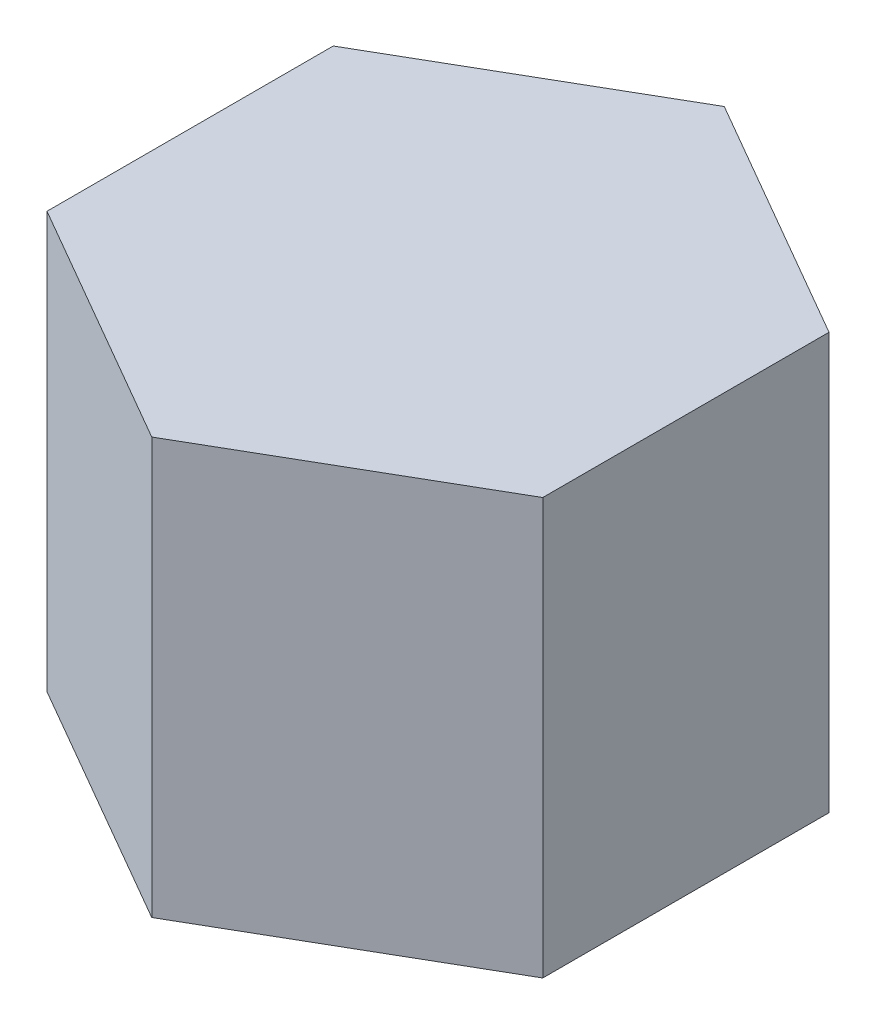
ISO-10303-21;
HEADER;
FILE_DESCRIPTION(('STEP AP214'),'2;1');
FILE_NAME('part.step','',(''),(''),'','','');
FILE_SCHEMA(('AUTOMOTIVE_DESIGN { 1 0 10303 214 1 1 1 1 }'));
ENDSEC;
DATA;
#1=APPLICATION_CONTEXT('core data for automotive mechanical design processes');
#2=APPLICATION_PROTOCOL_DEFINITION('international standard','automotive_design',2000,#1);
#3=PRODUCT_CONTEXT('',#1,'mechanical');
#4=PRODUCT('Part','Part','',(#3));
#5=PRODUCT_RELATED_PRODUCT_CATEGORY('part','',(#4));
#6=PRODUCT_DEFINITION_FORMATION('','',#4);
#7=PRODUCT_DEFINITION_CONTEXT('part definition',#1,'design');
#8=PRODUCT_DEFINITION('design','',#6,#7);
#9=PRODUCT_DEFINITION_SHAPE('','',#8);
#10=(LENGTH_UNIT() NAMED_UNIT(*) SI_UNIT(.MILLI.,.METRE.));
#11=(NAMED_UNIT(*) PLANE_ANGLE_UNIT() SI_UNIT($,.RADIAN.));
#12=(NAMED_UNIT(*) SI_UNIT($,.STERADIAN.) SOLID_ANGLE_UNIT());
#13=UNCERTAINTY_MEASURE_WITH_UNIT(LENGTH_MEASURE(1.E-05),#10,'distance_accuracy_value','');
#14=(GEOMETRIC_REPRESENTATION_CONTEXT(3) GLOBAL_UNCERTAINTY_ASSIGNED_CONTEXT((#13)) GLOBAL_UNIT_ASSIGNED_CONTEXT((#10,
#11,#12)) REPRESENTATION_CONTEXT('',''));
#15=CARTESIAN_POINT('',(0.,0.,0.));
#16=DIRECTION('',(0.,0.,1.));
#17=DIRECTION('',(1.,0.,0.));
#18=AXIS2_PLACEMENT_3D('',#15,#16,#17);
#19=CARTESIAN_POINT('',(210.839551417381,-147.556598747966,296.012098239417));
#20=DIRECTION('',(-0.500000000000062,0.,-0.866025403784403));
#21=DIRECTION('',(-0.866025403784403,0.,0.500000000000062));
#22=AXIS2_PLACEMENT_3D('',#19,#20,#21);
#23=PLANE('',#22);
#24=CARTESIAN_POINT('',(211.142660308706,-147.047793579175,295.837098239417));
#25=DIRECTION('',(-0.866025403784403,0.,0.500000000000062));
#26=VECTOR('',#25,1.);
#27=LINE('',#24,#26);
#28=CARTESIAN_POINT('',(211.142660308706,-147.047793579175,295.837098239417));
#29=VERTEX_POINT('',#28);
#30=CARTESIAN_POINT('',(210.839551417382,-147.047793579175,296.012098239417));
#31=VERTEX_POINT('',#30);
#32=EDGE_CURVE('E170',#29,#31,#27,.T.);
#33=ORIENTED_EDGE('',*,*,#32,.T.);
#34=CARTESIAN_POINT('',(210.839551417382,-147.556598747966,296.012098239417));
#35=DIRECTION('',(0.,1.,0.));
#36=VECTOR('',#35,1.);
#37=LINE('',#34,#36);
#38=CARTESIAN_POINT('',(210.839551417382,-147.556598747966,296.012098239417));
#39=VERTEX_POINT('',#38);
#40=EDGE_CURVE('E35',#39,#31,#37,.T.);
#41=ORIENTED_EDGE('',*,*,#40,.F.);
#42=CARTESIAN_POINT('',(211.142660308706,-147.556598747966,295.837098239417));
#43=DIRECTION('',(-0.866025403784403,0.,0.500000000000062));
#44=VECTOR('',#43,1.);
#45=LINE('',#42,#44);
#46=CARTESIAN_POINT('',(211.142660308706,-147.556598747966,295.837098239417));
#47=VERTEX_POINT('',#46);
#48=EDGE_CURVE('E159',#47,#39,#45,.T.);
#49=ORIENTED_EDGE('',*,*,#48,.F.);
#50=CARTESIAN_POINT('',(211.142660308706,-147.556598747966,295.837098239417));
#51=DIRECTION('',(0.,1.,0.));
#52=VECTOR('',#51,1.);
#53=LINE('',#50,#52);
#54=EDGE_CURVE('E10',#47,#29,#53,.T.);
#55=ORIENTED_EDGE('',*,*,#54,.T.);
#56=EDGE_LOOP('',(#33,#41,#49,#55));
#57=FACE_BOUND('',#56,.T.);
#58=ADVANCED_FACE('F16',(#57),#23,.F.);
#59=CARTESIAN_POINT('',(211.142660308706,-147.556598747966,291.594471220494));
#60=DIRECTION('',(-1.,0.,0.));
#61=DIRECTION('',(0.,-1.,0.));
#62=AXIS2_PLACEMENT_3D('',#59,#60,#61);
#63=PLANE('',#62);
#64=CARTESIAN_POINT('',(211.142660308706,-147.047793579175,295.487098239417));
#65=DIRECTION('',(0.,0.,1.));
#66=VECTOR('',#65,1.);
#67=LINE('',#64,#66);
#68=CARTESIAN_POINT('',(211.142660308706,-147.047793579175,295.487098239417));
#69=VERTEX_POINT('',#68);
#70=EDGE_CURVE('E167',#69,#29,#67,.T.);
#71=ORIENTED_EDGE('',*,*,#70,.T.);
#72=ORIENTED_EDGE('',*,*,#54,.F.);
#73=CARTESIAN_POINT('',(211.142660308706,-147.556598747966,295.487098239417));
#74=DIRECTION('',(0.,0.,1.));
#75=VECTOR('',#74,1.);
#76=LINE('',#73,#75);
#77=CARTESIAN_POINT('',(211.142660308706,-147.556598747966,295.487098239417));
#78=VERTEX_POINT('',#77);
#79=EDGE_CURVE('E156',#78,#47,#76,.T.);
#80=ORIENTED_EDGE('',*,*,#79,.F.);
#81=CARTESIAN_POINT('',(211.142660308706,-147.556598747966,295.487098239417));
#82=DIRECTION('',(0.,1.,0.));
#83=VECTOR('',#82,1.);
#84=LINE('',#81,#83);
#85=EDGE_CURVE('E27',#78,#69,#84,.T.);
#86=ORIENTED_EDGE('',*,*,#85,.T.);
#87=EDGE_LOOP('',(#71,#72,#80,#86));
#88=FACE_BOUND('',#87,.T.);
#89=ADVANCED_FACE('F189',(#88),#63,.F.);
#90=CARTESIAN_POINT('',(211.142660308706,-147.556598747966,295.487098239417));
#91=DIRECTION('',(-0.500000000000096,0.,0.866025403784383));
#92=DIRECTION('',(0.866025403784383,0.,0.500000000000096));
#93=AXIS2_PLACEMENT_3D('',#90,#91,#92);
#94=PLANE('',#93);
#95=CARTESIAN_POINT('',(210.839551417382,-147.047793579175,295.312098239417));
#96=DIRECTION('',(0.866025403784383,0.,0.500000000000096));
#97=VECTOR('',#96,1.);
#98=LINE('',#95,#97);
#99=CARTESIAN_POINT('',(210.839551417382,-147.047793579175,295.312098239417));
#100=VERTEX_POINT('',#99);
#101=EDGE_CURVE('E163',#100,#69,#98,.T.);
#102=ORIENTED_EDGE('',*,*,#101,.T.);
#103=ORIENTED_EDGE('',*,*,#85,.F.);
#104=CARTESIAN_POINT('',(210.839551417382,-147.556598747966,295.312098239417));
#105=DIRECTION('',(0.866025403784383,0.,0.500000000000096));
#106=VECTOR('',#105,1.);
#107=LINE('',#104,#106);
#108=CARTESIAN_POINT('',(210.839551417382,-147.556598747966,295.312098239417));
#109=VERTEX_POINT('',#108);
#110=EDGE_CURVE('E106',#109,#78,#107,.T.);
#111=ORIENTED_EDGE('',*,*,#110,.F.);
#112=CARTESIAN_POINT('',(210.839551417382,-147.556598747966,295.312098239417));
#113=DIRECTION('',(0.,1.,0.));
#114=VECTOR('',#113,1.);
#115=LINE('',#112,#114);
#116=EDGE_CURVE('E94',#109,#100,#115,.T.);
#117=ORIENTED_EDGE('',*,*,#116,.T.);
#118=EDGE_LOOP('',(#102,#103,#111,#117));
#119=FACE_BOUND('',#118,.T.);
#120=ADVANCED_FACE('F198',(#119),#94,.F.);
#121=CARTESIAN_POINT('',(210.839551417382,-147.556598747966,295.312098239417));
#122=DIRECTION('',(0.499999999999978,0.,0.866025403784452));
#123=DIRECTION('',(0.866025403784452,0.,-0.499999999999978));
#124=AXIS2_PLACEMENT_3D('',#121,#122,#123);
#125=PLANE('',#124);
#126=CARTESIAN_POINT('',(210.536442526057,-147.047793579175,295.487098239417));
#127=DIRECTION('',(0.866025403784452,0.,-0.499999999999978));
#128=VECTOR('',#127,1.);
#129=LINE('',#126,#128);
#130=CARTESIAN_POINT('',(210.536442526057,-147.047793579175,295.487098239417));
#131=VERTEX_POINT('',#130);
#132=EDGE_CURVE('E162',#131,#100,#129,.T.);
#133=ORIENTED_EDGE('',*,*,#132,.T.);
#134=ORIENTED_EDGE('',*,*,#116,.F.);
#135=CARTESIAN_POINT('',(210.536442526057,-147.556598747966,295.487098239417));
#136=DIRECTION('',(0.866025403784452,0.,-0.499999999999978));
#137=VECTOR('',#136,1.);
#138=LINE('',#135,#137);
#139=CARTESIAN_POINT('',(210.536442526057,-147.556598747966,295.487098239417));
#140=VERTEX_POINT('',#139);
#141=EDGE_CURVE('E98',#140,#109,#138,.T.);
#142=ORIENTED_EDGE('',*,*,#141,.F.);
#143=CARTESIAN_POINT('',(210.536442526057,-147.556598747966,295.487098239417));
#144=DIRECTION('',(0.,1.,0.));
#145=VECTOR('',#144,1.);
#146=LINE('',#143,#145);
#147=EDGE_CURVE('E79',#140,#131,#146,.T.);
#148=ORIENTED_EDGE('',*,*,#147,.T.);
#149=EDGE_LOOP('',(#133,#134,#142,#148));
#150=FACE_BOUND('',#149,.T.);
#151=ADVANCED_FACE('F100',(#150),#125,.F.);
#152=CARTESIAN_POINT('',(210.536442526057,-147.556598747966,291.594471220494));
#153=DIRECTION('',(1.,0.,0.));
#154=DIRECTION('',(0.,1.,0.));
#155=AXIS2_PLACEMENT_3D('',#152,#153,#154);
#156=PLANE('',#155);
#157=CARTESIAN_POINT('',(210.536442526057,-147.047793579175,295.837098239417));
#158=DIRECTION('',(0.,0.,-1.));
#159=VECTOR('',#158,1.);
#160=LINE('',#157,#159);
#161=CARTESIAN_POINT('',(210.536442526057,-147.047793579175,295.837098239417));
#162=VERTEX_POINT('',#161);
#163=EDGE_CURVE('E88',#162,#131,#160,.T.);
#164=ORIENTED_EDGE('',*,*,#163,.T.);
#165=ORIENTED_EDGE('',*,*,#147,.F.);
#166=CARTESIAN_POINT('',(210.536442526057,-147.556598747966,295.837098239417));
#167=DIRECTION('',(0.,0.,-1.));
#168=VECTOR('',#167,1.);
#169=LINE('',#166,#168);
#170=CARTESIAN_POINT('',(210.536442526057,-147.556598747966,295.837098239417));
#171=VERTEX_POINT('',#170);
#172=EDGE_CURVE('E84',#171,#140,#169,.T.);
#173=ORIENTED_EDGE('',*,*,#172,.F.);
#174=CARTESIAN_POINT('',(210.536442526057,-147.556598747966,295.837098239417));
#175=DIRECTION('',(0.,1.,0.));
#176=VECTOR('',#175,1.);
#177=LINE('',#174,#176);
#178=EDGE_CURVE('E58',#171,#162,#177,.T.);
#179=ORIENTED_EDGE('',*,*,#178,.T.);
#180=EDGE_LOOP('',(#164,#165,#173,#179));
#181=FACE_BOUND('',#180,.T.);
#182=ADVANCED_FACE('F82',(#181),#156,.F.);
#183=CARTESIAN_POINT('',(210.536442526057,-147.556598747966,295.837098239417));
#184=DIRECTION('',(0.500000000000096,0.,-0.866025403784383));
#185=DIRECTION('',(-0.866025403784383,0.,-0.500000000000096));
#186=AXIS2_PLACEMENT_3D('',#183,#184,#185);
#187=PLANE('',#186);
#188=CARTESIAN_POINT('',(210.839551417382,-147.047793579175,296.012098239417));
#189=DIRECTION('',(-0.866025403784383,0.,-0.500000000000096));
#190=VECTOR('',#189,1.);
#191=LINE('',#188,#190);
#192=EDGE_CURVE('E160',#31,#162,#191,.T.);
#193=ORIENTED_EDGE('',*,*,#192,.T.);
#194=ORIENTED_EDGE('',*,*,#178,.F.);
#195=CARTESIAN_POINT('',(210.839551417382,-147.556598747966,296.012098239417));
#196=DIRECTION('',(-0.866025403784383,0.,-0.500000000000096));
#197=VECTOR('',#196,1.);
#198=LINE('',#195,#197);
#199=EDGE_CURVE('E112',#39,#171,#198,.T.);
#200=ORIENTED_EDGE('',*,*,#199,.F.);
#201=ORIENTED_EDGE('',*,*,#40,.T.);
#202=EDGE_LOOP('',(#193,#194,#200,#201));
#203=FACE_BOUND('',#202,.T.);
#204=ADVANCED_FACE('F131',(#203),#187,.F.);
#205=CARTESIAN_POINT('',(206.491105863044,-147.556598747966,291.594471220494));
#206=DIRECTION('',(0.,1.,0.));
#207=DIRECTION('',(-1.,0.,0.));
#208=AXIS2_PLACEMENT_3D('',#205,#206,#207);
#209=PLANE('',#208);
#210=ORIENTED_EDGE('',*,*,#48,.T.);
#211=ORIENTED_EDGE('',*,*,#199,.T.);
#212=ORIENTED_EDGE('',*,*,#172,.T.);
#213=ORIENTED_EDGE('',*,*,#141,.T.);
#214=ORIENTED_EDGE('',*,*,#110,.T.);
#215=ORIENTED_EDGE('',*,*,#79,.T.);
#216=EDGE_LOOP('',(#210,#211,#212,#213,#214,#215));
#217=FACE_BOUND('',#216,.T.);
#218=ADVANCED_FACE('F111',(#217),#209,.F.);
#219=CARTESIAN_POINT('',(206.491105863044,-147.047793579175,291.594471220494));
#220=DIRECTION('',(0.,1.,0.));
#221=DIRECTION('',(-1.,0.,0.));
#222=AXIS2_PLACEMENT_3D('',#219,#220,#221);
#223=PLANE('',#222);
#224=ORIENTED_EDGE('',*,*,#32,.F.);
#225=ORIENTED_EDGE('',*,*,#70,.F.);
#226=ORIENTED_EDGE('',*,*,#101,.F.);
#227=ORIENTED_EDGE('',*,*,#132,.F.);
#228=ORIENTED_EDGE('',*,*,#163,.F.);
#229=ORIENTED_EDGE('',*,*,#192,.F.);
#230=EDGE_LOOP('',(#224,#225,#226,#227,#228,#229));
#231=FACE_BOUND('',#230,.T.);
#232=ADVANCED_FACE('F130',(#231),#223,.T.);
#233=CLOSED_SHELL('',(#58,#89,#120,#151,#182,#204,#218,#232));
#234=MANIFOLD_SOLID_BREP('B1',#233);
#235=ADVANCED_BREP_SHAPE_REPRESENTATION('',(#18,#234),#14);
#236=SHAPE_DEFINITION_REPRESENTATION(#9,#235);
ENDSEC;
END-ISO-10303-21;
